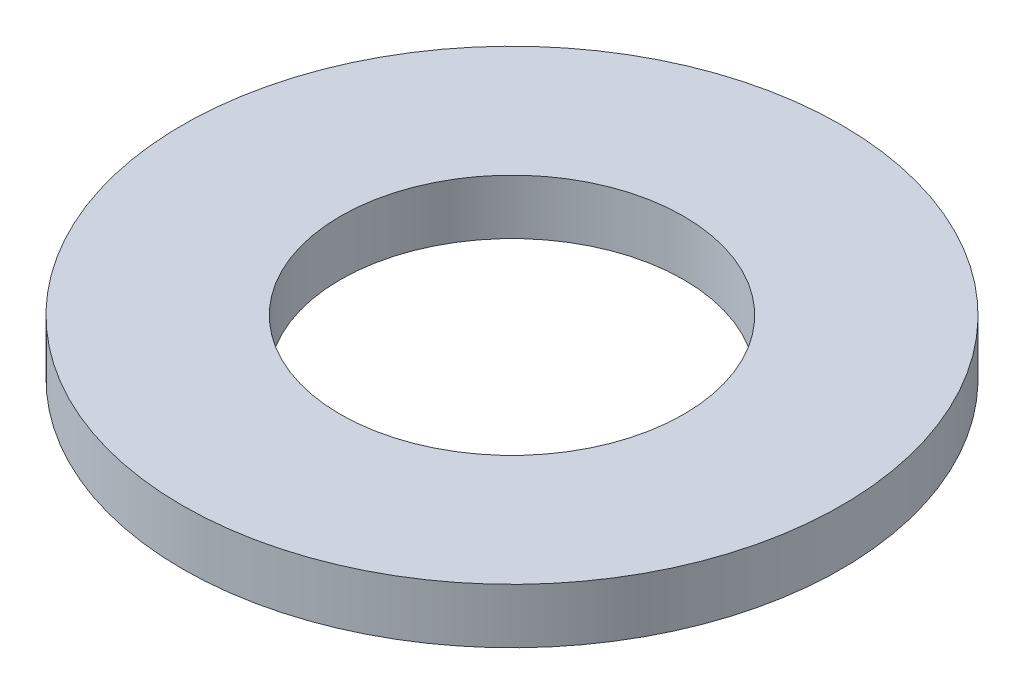
ISO-10303-21;
HEADER;
FILE_DESCRIPTION(('STEP AP214'),'2;1');
FILE_NAME('part.step','',(''),(''),'','','');
FILE_SCHEMA(('AUTOMOTIVE_DESIGN { 1 0 10303 214 1 1 1 1 }'));
ENDSEC;
DATA;
#1=APPLICATION_CONTEXT('core data for automotive mechanical design processes');
#2=APPLICATION_PROTOCOL_DEFINITION('international standard','automotive_design',2000,#1);
#3=PRODUCT_CONTEXT('',#1,'mechanical');
#4=PRODUCT('Part','Part','',(#3));
#5=PRODUCT_RELATED_PRODUCT_CATEGORY('part','',(#4));
#6=PRODUCT_DEFINITION_FORMATION('','',#4);
#7=PRODUCT_DEFINITION_CONTEXT('part definition',#1,'design');
#8=PRODUCT_DEFINITION('design','',#6,#7);
#9=PRODUCT_DEFINITION_SHAPE('','',#8);
#10=(LENGTH_UNIT() NAMED_UNIT(*) SI_UNIT(.MILLI.,.METRE.));
#11=(NAMED_UNIT(*) PLANE_ANGLE_UNIT() SI_UNIT($,.RADIAN.));
#12=(NAMED_UNIT(*) SI_UNIT($,.STERADIAN.) SOLID_ANGLE_UNIT());
#13=UNCERTAINTY_MEASURE_WITH_UNIT(LENGTH_MEASURE(1.E-05),#10,'distance_accuracy_value','');
#14=(GEOMETRIC_REPRESENTATION_CONTEXT(3) GLOBAL_UNCERTAINTY_ASSIGNED_CONTEXT((#13)) GLOBAL_UNIT_ASSIGNED_CONTEXT((#10,
#11,#12)) REPRESENTATION_CONTEXT('',''));
#15=CARTESIAN_POINT('',(0.,0.,0.));
#16=DIRECTION('',(0.,0.,1.));
#17=DIRECTION('',(1.,0.,0.));
#18=AXIS2_PLACEMENT_3D('',#15,#16,#17);
#19=CARTESIAN_POINT('',(0.,0.5,0.));
#20=DIRECTION('',(0.,1.,0.));
#21=DIRECTION('',(0.,0.,1.));
#22=AXIS2_PLACEMENT_3D('',#19,#20,#21);
#23=PLANE('',#22);
#24=CARTESIAN_POINT('',(0.,0.5,0.));
#25=DIRECTION('',(0.,1.,0.));
#26=DIRECTION('',(0.,0.,1.));
#27=AXIS2_PLACEMENT_3D('',#24,#25,#26);
#28=CIRCLE('',#27,6.);
#29=CARTESIAN_POINT('',(0.,0.5,6.));
#30=VERTEX_POINT('',#29);
#31=EDGE_CURVE('E10',#30,#30,#28,.T.);
#32=ORIENTED_EDGE('',*,*,#31,.T.);
#33=EDGE_LOOP('',(#32));
#34=FACE_BOUND('',#33,.T.);
#35=CARTESIAN_POINT('',(0.,0.5,0.));
#36=DIRECTION('',(0.,1.,0.));
#37=DIRECTION('',(0.,0.,1.));
#38=AXIS2_PLACEMENT_3D('',#35,#36,#37);
#39=CIRCLE('',#38,3.125);
#40=CARTESIAN_POINT('',(0.,0.5,3.125));
#41=VERTEX_POINT('',#40);
#42=EDGE_CURVE('E42',#41,#41,#39,.T.);
#43=ORIENTED_EDGE('',*,*,#42,.F.);
#44=EDGE_LOOP('',(#43));
#45=FACE_BOUND('',#44,.T.);
#46=ADVANCED_FACE('F31',(#34,#45),#23,.T.);
#47=CARTESIAN_POINT('',(0.,-0.5,0.));
#48=DIRECTION('',(0.,1.,0.));
#49=DIRECTION('',(0.,0.,1.));
#50=AXIS2_PLACEMENT_3D('',#47,#48,#49);
#51=PLANE('',#50);
#52=CARTESIAN_POINT('',(0.,-0.5,0.));
#53=DIRECTION('',(0.,1.,0.));
#54=DIRECTION('',(0.,0.,1.));
#55=AXIS2_PLACEMENT_3D('',#52,#53,#54);
#56=CIRCLE('',#55,6.);
#57=CARTESIAN_POINT('',(0.,-0.5,6.));
#58=VERTEX_POINT('',#57);
#59=EDGE_CURVE('E35',#58,#58,#56,.T.);
#60=ORIENTED_EDGE('',*,*,#59,.F.);
#61=EDGE_LOOP('',(#60));
#62=FACE_BOUND('',#61,.T.);
#63=CARTESIAN_POINT('',(0.,-0.5,0.));
#64=DIRECTION('',(0.,1.,0.));
#65=DIRECTION('',(0.,0.,1.));
#66=AXIS2_PLACEMENT_3D('',#63,#64,#65);
#67=CIRCLE('',#66,3.125);
#68=CARTESIAN_POINT('',(0.,-0.5,3.125));
#69=VERTEX_POINT('',#68);
#70=EDGE_CURVE('E44',#69,#69,#67,.T.);
#71=ORIENTED_EDGE('',*,*,#70,.T.);
#72=EDGE_LOOP('',(#71));
#73=FACE_BOUND('',#72,.T.);
#74=ADVANCED_FACE('F54',(#62,#73),#51,.F.);
#75=CARTESIAN_POINT('',(0.,0.5,0.));
#76=DIRECTION('',(0.,-1.,0.));
#77=DIRECTION('',(0.,0.,-1.));
#78=AXIS2_PLACEMENT_3D('',#75,#76,#77);
#79=CYLINDRICAL_SURFACE('',#78,6.);
#80=ORIENTED_EDGE('',*,*,#31,.F.);
#81=EDGE_LOOP('',(#80));
#82=FACE_BOUND('',#81,.T.);
#83=ORIENTED_EDGE('',*,*,#59,.T.);
#84=EDGE_LOOP('',(#83));
#85=FACE_BOUND('',#84,.T.);
#86=ADVANCED_FACE('F33',(#82,#85),#79,.T.);
#87=CARTESIAN_POINT('',(0.,0.5,0.));
#88=DIRECTION('',(0.,-1.,0.));
#89=DIRECTION('',(0.,0.,-1.));
#90=AXIS2_PLACEMENT_3D('',#87,#88,#89);
#91=CYLINDRICAL_SURFACE('',#90,3.125);
#92=ORIENTED_EDGE('',*,*,#42,.T.);
#93=EDGE_LOOP('',(#92));
#94=FACE_BOUND('',#93,.T.);
#95=ORIENTED_EDGE('',*,*,#70,.F.);
#96=EDGE_LOOP('',(#95));
#97=FACE_BOUND('',#96,.T.);
#98=ADVANCED_FACE('F50',(#94,#97),#91,.F.);
#99=CLOSED_SHELL('',(#46,#74,#86,#98));
#100=MANIFOLD_SOLID_BREP('B2',#99);
#101=ADVANCED_BREP_SHAPE_REPRESENTATION('',(#18,#100),#14);
#102=SHAPE_DEFINITION_REPRESENTATION(#9,#101);
ENDSEC;
END-ISO-10303-21;
